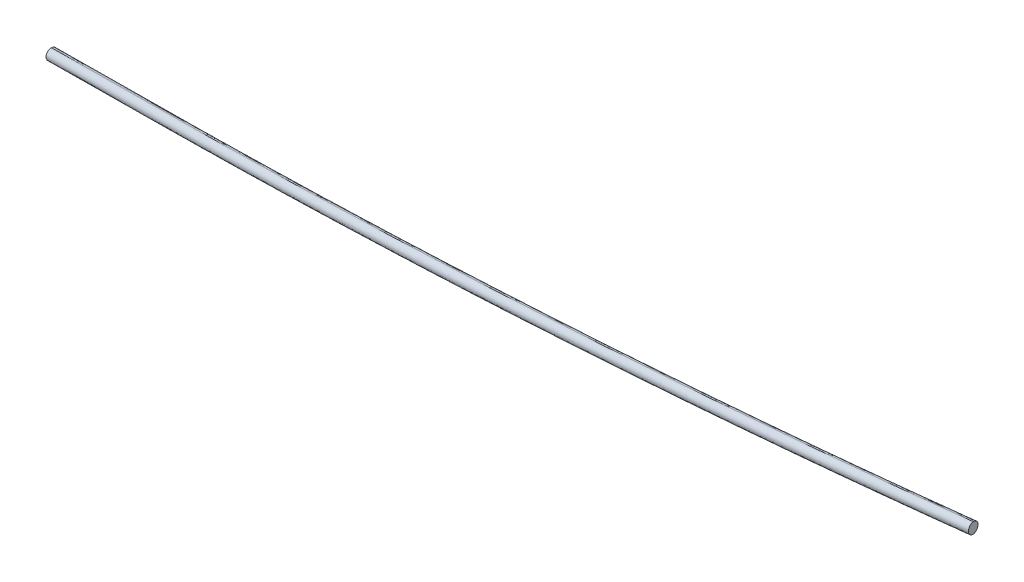
ISO-10303-21;
HEADER;
FILE_DESCRIPTION(('STEP AP214'),'2;1');
FILE_NAME('part.step','',(''),(''),'','','');
FILE_SCHEMA(('AUTOMOTIVE_DESIGN { 1 0 10303 214 1 1 1 1 }'));
ENDSEC;
DATA;
#1=APPLICATION_CONTEXT('core data for automotive mechanical design processes');
#2=APPLICATION_PROTOCOL_DEFINITION('international standard','automotive_design',2000,#1);
#3=PRODUCT_CONTEXT('',#1,'mechanical');
#4=PRODUCT('Part','Part','',(#3));
#5=PRODUCT_RELATED_PRODUCT_CATEGORY('part','',(#4));
#6=PRODUCT_DEFINITION_FORMATION('','',#4);
#7=PRODUCT_DEFINITION_CONTEXT('part definition',#1,'design');
#8=PRODUCT_DEFINITION('design','',#6,#7);
#9=PRODUCT_DEFINITION_SHAPE('','',#8);
#10=(LENGTH_UNIT() NAMED_UNIT(*) SI_UNIT(.MILLI.,.METRE.));
#11=(NAMED_UNIT(*) PLANE_ANGLE_UNIT() SI_UNIT($,.RADIAN.));
#12=(NAMED_UNIT(*) SI_UNIT($,.STERADIAN.) SOLID_ANGLE_UNIT());
#13=UNCERTAINTY_MEASURE_WITH_UNIT(LENGTH_MEASURE(1.E-05),#10,'distance_accuracy_value','');
#14=(GEOMETRIC_REPRESENTATION_CONTEXT(3) GLOBAL_UNCERTAINTY_ASSIGNED_CONTEXT((#13)) GLOBAL_UNIT_ASSIGNED_CONTEXT((#10,
#11,#12)) REPRESENTATION_CONTEXT('',''));
#15=CARTESIAN_POINT('',(0.,0.,0.));
#16=DIRECTION('',(0.,0.,1.));
#17=DIRECTION('',(1.,0.,0.));
#18=AXIS2_PLACEMENT_3D('',#15,#16,#17);
#19=CARTESIAN_POINT('',(47.8367929704556,0.820702680328424,-12.776442060778));
#20=DIRECTION('',(-0.993859021947617,-0.00906660618532011,0.110281644645005));
#21=DIRECTION('',(-0.00912224846437236,0.99995839142584,0.));
#22=AXIS2_PLACEMENT_3D('',#19,#20,#21);
#23=PLANE('',#22);
#24=CARTESIAN_POINT('',(47.8390735325717,0.570713082471964,-12.776442060778));
#25=CARTESIAN_POINT('',(47.835650118051,0.570681851934652,-12.807296466093));
#26=CARTESIAN_POINT('',(47.8287056984545,0.581317026962421,-12.869005276723));
#27=CARTESIAN_POINT('',(47.8183769649011,0.638470414265478,-12.957389139686));
#28=CARTESIAN_POINT('',(47.8112533891388,0.727334317022408,-13.014281073511));
#29=CARTESIAN_POINT('',(47.8086324819121,0.820445782665907,-13.030245718498));
#30=CARTESIAN_POINT('',(47.8095589219592,0.913589609439128,-13.014238982254));
#31=CARTESIAN_POINT('',(47.8150367514686,1.00256847012918,-12.957557504717));
#32=CARTESIAN_POINT('',(47.8244098081276,1.05990158953615,-12.868373907854));
#33=CARTESIAN_POINT('',(47.8311123447472,1.07066126066941,-12.807086009803));
#34=CARTESIAN_POINT('',(47.8345124083395,1.07069227818488,-12.776442060778));
#35=B_SPLINE_CURVE_WITH_KNOTS('',3,(#24,#25,#26,#27,#28,#29,#30,#31,#32,#33,#34),.UNSPECIFIED.,
.F.,.F.,(4,1,1,1,1,1,1,1,4),(0.,0.125,0.25,0.375,0.5,0.625,0.75,0.875,1.),.UNSPECIFIED.);
#36=CARTESIAN_POINT('',(47.8390735325717,0.570713082471964,-12.776442060778));
#37=VERTEX_POINT('',#36);
#38=CARTESIAN_POINT('',(47.8345124083395,1.07069227818488,-12.776442060778));
#39=VERTEX_POINT('',#38);
#40=EDGE_CURVE('E11',#37,#39,#35,.T.);
#41=ORIENTED_EDGE('',*,*,#40,.T.);
#42=CARTESIAN_POINT('',(47.8345124083395,1.07069227818488,-12.776442060778));
#43=CARTESIAN_POINT('',(47.8379124719318,1.07072329570036,-12.745798111752));
#44=CARTESIAN_POINT('',(47.8448101896615,1.06008769462883,-12.684510213701));
#45=CARTESIAN_POINT('',(47.8552276567527,1.00293511680884,-12.595326616839));
#46=CARTESIAN_POINT('',(47.8623278815767,0.914071001029983,-12.538645139302));
#47=CARTESIAN_POINT('',(47.864953458999,0.820959577990941,-12.522638403058));
#48=CARTESIAN_POINT('',(47.8640316891276,0.727815793821996,-12.538603048044));
#49=CARTESIAN_POINT('',(47.8585305086899,0.638836720110108,-12.59549498187));
#50=CARTESIAN_POINT('',(47.8492461855786,0.581504410186295,-12.683878844833));
#51=CARTESIAN_POINT('',(47.8424969470923,0.570744313009276,-12.745587655463));
#52=CARTESIAN_POINT('',(47.8390735325717,0.570713082471964,-12.776442060778));
#53=B_SPLINE_CURVE_WITH_KNOTS('',3,(#42,#43,#44,#45,#46,#47,#48,#49,#50,#51,#52),.UNSPECIFIED.,
.F.,.F.,(4,1,1,1,1,1,1,1,4),(0.,0.125,0.25,0.375,0.5,0.625,0.75,0.875,1.),.UNSPECIFIED.);
#54=EDGE_CURVE('E72',#39,#37,#53,.T.);
#55=ORIENTED_EDGE('',*,*,#54,.T.);
#56=EDGE_LOOP('',(#41,#55));
#57=FACE_BOUND('',#56,.T.);
#58=ADVANCED_FACE('F17',(#57),#23,.F.);
#59=CARTESIAN_POINT('',(6.49585297667772,0.309157456370087,-10.5891469422591));
#60=CARTESIAN_POINT('',(7.09129993623582,0.314589497502017,-10.589392958671));
#61=CARTESIAN_POINT('',(8.42600871502778,0.326765549237888,-10.588987452871));
#62=CARTESIAN_POINT('',(10.499330979002,0.345679697067298,-10.5899390919028));
#63=CARTESIAN_POINT('',(13.7338468100071,0.375186981895722,-10.5859629169388));
#64=CARTESIAN_POINT('',(26.3486769569708,0.490267385163673,-10.7117000519929));
#65=CARTESIAN_POINT('',(38.2118509161581,0.598490708613632,-11.4837330270633));
#66=CARTESIAN_POINT('',(48.2690194370734,0.690238516204942,-12.612487255157));
#67=CARTESIAN_POINT('',(6.49598846455756,0.294008844717859,-10.5988382920499));
#68=CARTESIAN_POINT('',(7.09144137670697,0.299440940153066,-10.5990846143667));
#69=CARTESIAN_POINT('',(8.42614154023141,0.311616913295056,-10.5986786706191));
#70=CARTESIAN_POINT('',(10.4994759933554,0.330531172321546,-10.5996309702892));
#71=CARTESIAN_POINT('',(13.7339328218126,0.360037918891672,-10.5956537595946));
#72=CARTESIAN_POINT('',(26.3484130663359,0.475115130129807,-10.7213902459349));
#73=CARTESIAN_POINT('',(38.2111858391367,0.583334793705585,-11.4933944191897));
#74=CARTESIAN_POINT('',(48.2680776286069,0.675080076778853,-12.622118407163));
#75=CARTESIAN_POINT('',(6.49635785259717,0.252507848513258,-10.631808189512));
#76=CARTESIAN_POINT('',(7.09183101541794,0.257940128687807,-10.6320555525151));
#77=CARTESIAN_POINT('',(8.42650186986894,0.270115834454022,-10.6316481188736));
#78=CARTESIAN_POINT('',(10.4998777903845,0.289030471772101,-10.6326026660299));
#79=CARTESIAN_POINT('',(13.734133892645,0.318535387191795,-10.6286219317877));
#80=CARTESIAN_POINT('',(26.3474237717597,0.433601739169072,-10.7543562112083));
#81=CARTESIAN_POINT('',(38.2088317115316,0.541808951880785,-11.5262624009081));
#82=CARTESIAN_POINT('',(48.2647820627853,0.633545646563378,-12.654883512225));
#83=CARTESIAN_POINT('',(6.49677705164663,0.204261215579839,-10.7067575492373));
#84=CARTESIAN_POINT('',(7.09229624963687,0.209693915716116,-10.7070072779977));
#85=CARTESIAN_POINT('',(8.42690047675625,0.221869013665967,-10.7065964574302));
#86=CARTESIAN_POINT('',(10.5003706636983,0.240784510941592,-10.7075561137215));
#87=CARTESIAN_POINT('',(13.7341704618318,0.27028526366846,-10.703567369517));
#88=CARTESIAN_POINT('',(26.3447543232747,0.385326929653038,-10.8292966320212));
#89=CARTESIAN_POINT('',(38.203059634008,0.493505838234073,-11.600980078999));
#90=CARTESIAN_POINT('',(48.2568698454036,0.585223009216778,-12.729367324269));
#91=CARTESIAN_POINT('',(6.49689742387773,0.188214524113787,-10.7998874906785));
#92=CARTESIAN_POINT('',(7.09247382385978,0.193647746082559,-10.8001401590615));
#93=CARTESIAN_POINT('',(8.42699526175304,0.205822088777094,-10.7997251299962));
#94=CARTESIAN_POINT('',(10.5005825814752,0.224738654611504,-10.8006911347533));
#95=CARTESIAN_POINT('',(13.7338153890903,0.254234234894768,-10.7966924375975));
#96=CARTESIAN_POINT('',(26.3410368299746,0.369245226767262,-10.9224154662242));
#97=CARTESIAN_POINT('',(38.1954869021655,0.477388965441055,-11.6938221394345));
#98=CARTESIAN_POINT('',(48.2466378366644,0.569081876829766,-12.821918789411));
#99=CARTESIAN_POINT('',(6.4967250244435,0.204260740955017,-10.8930174321198));
#100=CARTESIAN_POINT('',(7.09235862641735,0.209694484756283,-10.8932730401253));
#101=CARTESIAN_POINT('',(8.4267972750845,0.221868072195502,-10.8928538025623));
#102=CARTESIAN_POINT('',(10.5005017275857,0.240785706588687,-10.8938261557851));
#103=CARTESIAN_POINT('',(13.7331675446835,0.270276114428358,-10.889817505678));
#104=CARTESIAN_POINT('',(26.3370265650091,0.385256432188767,-11.0155343004272));
#105=CARTESIAN_POINT('',(38.1876213986576,0.493365000955318,-11.7866641998701));
#106=CARTESIAN_POINT('',(48.2361130562699,0.585033652750126,-12.914470254553));
#107=CARTESIAN_POINT('',(6.49617798017498,0.261503362971062,-10.9819424321647));
#108=CARTESIAN_POINT('',(7.09186620139411,0.266937605043387,-10.9822008470649));
#109=CARTESIAN_POINT('',(8.42622579887861,0.27911047132807,-10.9817775910234));
#110=CARTESIAN_POINT('',(10.5000420954579,0.298029126033178,-10.9827560060702));
#111=CARTESIAN_POINT('',(13.7321665224111,0.327514594971933,-10.9787378524009));
#112=CARTESIAN_POINT('',(26.3328149399709,0.442465623597513,-11.1044486947406));
#113=CARTESIAN_POINT('',(38.179728604254,0.550540610425176,-11.875314317122));
#114=CARTESIAN_POINT('',(48.2256810548835,0.642186097979154,-13.002842897277));
#115=CARTESIAN_POINT('',(6.495350793828,0.350424705346647,-11.0391826912847));
#116=CARTESIAN_POINT('',(7.0910741729852,0.355859268151764,-11.0394429129591));
#117=CARTESIAN_POINT('',(8.42538288590402,0.368031670235481,-11.0390170702574));
#118=CARTESIAN_POINT('',(10.4992711755557,0.38695098170661,-11.0399993872483));
#119=CARTESIAN_POINT('',(13.7310471143236,0.416433271517273,-11.0359751162176));
#120=CARTESIAN_POINT('',(26.3296288944468,0.531365446978217,-11.1616821270423));
#121=CARTESIAN_POINT('',(38.1741730216071,0.639418817400073,-11.932377636548));
#122=CARTESIAN_POINT('',(48.2184910064971,0.731049394331059,-13.059727608732));
#123=CARTESIAN_POINT('',(6.49449673850406,0.443552289322863,-11.0552450810527));
#124=CARTESIAN_POINT('',(7.09022998345474,0.448986942129945,-11.0555058097322));
#125=CARTESIAN_POINT('',(8.42452441747571,0.461159213952588,-11.0550792411788));
#126=CARTESIAN_POINT('',(10.4984329093568,0.480078709721141,-11.0560626531079));
#127=CARTESIAN_POINT('',(13.7301110576397,0.509560107425584,-11.052036665463));
#128=CARTESIAN_POINT('',(26.3281129113838,0.62448699243388,-11.1777426011129));
#129=CARTESIAN_POINT('',(38.1719921144218,0.732534297000289,-11.948390374648));
#130=CARTESIAN_POINT('',(48.2158514461566,0.824160689809139,-13.075690227023));
#131=CARTESIAN_POINT('',(6.49365166829125,0.536679955266907,-11.0391403423198));
#132=CARTESIAN_POINT('',(7.08937502143853,0.542114517834745,-11.0394005626574));
#133=CARTESIAN_POINT('',(8.42368377200278,0.554286920261888,-11.0389747218695));
#134=CARTESIAN_POINT('',(10.4975720083917,0.573206231247121,-11.0399570359736));
#135=CARTESIAN_POINT('',(13.7293482049888,0.602688523409864,-11.0359327694688));
#136=CARTESIAN_POINT('',(26.3279315140984,0.717620712819182,-11.1616397831282));
#137=CARTESIAN_POINT('',(38.1724773943558,0.82567409923389,-11.932335418491));
#138=CARTESIAN_POINT('',(48.2167965884955,0.917304687196412,-13.059685522817));
#139=CARTESIAN_POINT('',(6.49285640016814,0.625601588820576,-10.9821118280243));
#140=CARTESIAN_POINT('',(7.08854472543294,0.631035831842072,-10.9823702482715));
#141=CARTESIAN_POINT('',(8.4229041723317,0.643208696753017,-10.981946984575));
#142=CARTESIAN_POINT('',(10.4967206819662,0.662127353401748,-10.9829254111692));
#143=CARTESIAN_POINT('',(13.7288440776093,0.691612812932245,-10.9789072393963));
#144=CARTESIAN_POINT('',(26.3294863792035,0.806563785764147,-11.104618070397));
#145=CARTESIAN_POINT('',(38.1763930311085,0.914638708620491,-11.875483189349));
#146=CARTESIAN_POINT('',(48.2223406447292,1.00628415204824,-13.003011240935));
#147=CARTESIAN_POINT('',(6.49235925875915,0.682844666081847,-10.8923821976463));
#148=CARTESIAN_POINT('',(7.08799247056124,0.688278406323722,-10.8926377856008));
#149=CARTESIAN_POINT('',(8.42243168392889,0.700451998914493,-10.8922185767437));
#150=CARTESIAN_POINT('',(10.4961353374743,0.719369626019102,-10.893190886664));
#151=CARTESIAN_POINT('',(13.7288050219792,0.748860069139689,-10.8891823044454));
#152=CARTESIAN_POINT('',(26.3326869772105,0.863840596126712,-11.0148991417156));
#153=CARTESIAN_POINT('',(38.1833081072348,0.971949404785318,-11.7860309290179));
#154=CARTESIAN_POINT('',(48.2318179036323,1.06361822205352,-12.913838965836));
#155=CARTESIAN_POINT('',(6.49223870909043,0.698891355929201,-10.7998874906785));
#156=CARTESIAN_POINT('',(7.08781510907248,0.704324577897973,-10.8001401590615));
#157=CARTESIAN_POINT('',(8.42233654696575,0.716498920592508,-10.7997251299962));
#158=CARTESIAN_POINT('',(10.4959238666879,0.735415486426917,-10.8006911347533));
#159=CARTESIAN_POINT('',(13.729156674303,0.764911066710182,-10.7966924375975));
#160=CARTESIAN_POINT('',(26.3363781151873,0.879922058582676,-10.9224154662242));
#161=CARTESIAN_POINT('',(38.1908281873782,0.988065797256469,-11.6938221394345));
#162=CARTESIAN_POINT('',(48.2419791218771,1.07975870864518,-12.821918789411));
#163=CARTESIAN_POINT('',(6.49241093108805,0.682845137469284,-10.7073927837108));
#164=CARTESIAN_POINT('',(7.08793051924905,0.688277841164944,-10.7076425325222));
#165=CARTESIAN_POINT('',(8.42253418166793,0.700452933963242,-10.7072316832488));
#166=CARTESIAN_POINT('',(10.4960051675668,0.719368438527452,-10.7081913828426));
#167=CARTESIAN_POINT('',(13.7298010982921,0.748869155973395,-10.7042025707495));
#168=CARTESIAN_POINT('',(26.3403620248294,0.863910612731359,-10.8299317907328));
#169=CARTESIAN_POINT('',(38.1986410391868,0.972089281420339,-11.6016133498511));
#170=CARTESIAN_POINT('',(48.2524331117872,1.06380628692956,-12.729998612986));
#171=CARTESIAN_POINT('',(6.49287219015838,0.634598888233791,-10.6317652510504));
#172=CARTESIAN_POINT('',(7.08834532660426,0.640031168167731,-10.6320126126982));
#173=CARTESIAN_POINT('',(8.42301621922666,0.65220687428217,-10.631605180997));
#174=CARTESIAN_POINT('',(10.4963920857364,0.671121511107574,-10.6325597252264));
#175=CARTESIAN_POINT('',(13.7306484494121,0.700626428912061,-10.6285789955731));
#176=CARTESIAN_POINT('',(26.3439398788023,0.815692795031925,-10.7543132778678));
#177=CARTESIAN_POINT('',(38.2053495960702,0.923900023959073,-11.5262195951769));
#178=CARTESIAN_POINT('',(48.2613011734129,1.01563672982682,-12.654840840475));
#179=CARTESIAN_POINT('',(6.49326000085342,0.593098060092222,-10.5987811594707));
#180=CARTESIAN_POINT('',(7.08871287791129,0.598530155207302,-10.5990274799841));
#181=CARTESIAN_POINT('',(8.42341309222461,0.61070612881262,-10.5986215388184));
#182=CARTESIAN_POINT('',(10.4967474734906,0.629620387183576,-10.5995738345938));
#183=CARTESIAN_POINT('',(13.7312046497773,0.659127136926821,-10.5955966300051));
#184=CARTESIAN_POINT('',(26.3456869570548,0.774204366982696,-10.7213331201696));
#185=CARTESIAN_POINT('',(38.2084620949271,0.882424052134142,-11.4933374632173));
#186=CARTESIAN_POINT('',(48.2653555157995,0.974169350090085,-12.622061629463));
#187=CARTESIAN_POINT('',(6.4934008997081,0.577949497802306,-10.5891009591103));
#188=CARTESIAN_POINT('',(7.08884783102238,0.583381538676578,-10.5893469740708));
#189=CARTESIAN_POINT('',(8.42355665069163,0.595557590785358,-10.5889414703487));
#190=CARTESIAN_POINT('',(10.4968788568312,0.614471738087164,-10.5898931062459));
#191=CARTESIAN_POINT('',(13.7313949677827,0.643979025469434,-10.5859169361962));
#192=CARTESIAN_POINT('',(26.3462267749573,0.759059443882872,-10.7116540743284));
#193=CARTESIAN_POINT('',(38.2094026376754,0.867282784698034,-11.4836871860565));
#194=CARTESIAN_POINT('',(48.2665724716161,0.959030604267586,-12.612441557633));
#195=B_SPLINE_SURFACE_WITH_KNOTS('',3,3,((#59,#60,#61,#62,#63,#64,#65,#66),(#67,#68,#69,#70,#71,
#72,#73,#74),(#75,#76,#77,#78,#79,#80,#81,#82),(#83,#84,#85,#86,#87,#88,#89,#90),(#91,#92,#93,
#94,#95,#96,#97,#98),(#99,#100,#101,#102,#103,#104,#105,#106),(#107,#108,#109,#110,#111,#112,
#113,#114),(#115,#116,#117,#118,#119,#120,#121,#122),(#123,#124,#125,#126,#127,#128,#129,#130),
(#131,#132,#133,#134,#135,#136,#137,#138),(#139,#140,#141,#142,#143,#144,#145,#146),(#147,#148,
#149,#150,#151,#152,#153,#154),(#155,#156,#157,#158,#159,#160,#161,#162),(#163,#164,#165,#166,
#167,#168,#169,#170),(#171,#172,#173,#174,#175,#176,#177,#178),(#179,#180,#181,#182,#183,#184,
#185,#186),(#187,#188,#189,#190,#191,#192,#193,#194)),.UNSPECIFIED.,.F.,.F.,.F.,(4,1,1,1,1,1,1,
1,1,1,1,1,1,1,4),(4,1,1,1,1,4),(0.,0.0404773357775488,0.117064446481301,0.193651557185053,
0.270238667888805,0.346825778592557,0.423412889296309,0.500000000000061,0.576587110703813,
0.653174221407565,0.729761332111317,0.80634844281507,0.882935553518822,0.959522664222574,1.),
(0.,0.0427231708491105,0.0957280892241252,0.148730618500451,0.274614629049837,1.),.UNSPECIFIED.);
#196=CARTESIAN_POINT('',(6.90199546095475,0.697280151172529,-10.8));
#197=CARTESIAN_POINT('',(7.36100954674141,0.70146756594408,-10.8000660708699));
#198=CARTESIAN_POINT('',(8.55896883985224,0.712396102986885,-10.7997887590063));
#199=CARTESIAN_POINT('',(10.4959726619654,0.730066668375671,-10.8006911347533));
#200=CARTESIAN_POINT('',(13.7292054695805,0.759562248658936,-10.7966924375975));
#201=CARTESIAN_POINT('',(26.1997588695338,0.873326468828524,-10.9210525711483));
#202=CARTESIAN_POINT('',(37.9178573123176,0.980226322304054,-11.6761426005174));
#203=CARTESIAN_POINT('',(47.8345124083395,1.07069227818488,-12.776442060778));
#204=B_SPLINE_CURVE_WITH_KNOTS('',3,(#196,#197,#198,#199,#200,#201,#202,#203),.UNSPECIFIED.,.F.,
.F.,(4,1,1,1,1,4),(0.,0.03358479009447,0.08764933799105,0.1417114490281,0.270112026303,1.),.UNSPECIFIED.);
#205=CARTESIAN_POINT('',(6.90199546095475,0.697280151172529,-10.8));
#206=VERTEX_POINT('',#205);
#207=EDGE_CURVE('E67',#206,#39,#204,.T.);
#208=CARTESIAN_POINT('',(6.90655658518693,0.197300955459609,-10.8));
#209=CARTESIAN_POINT('',(7.36557067097359,0.20148837023116,-10.8000660708699));
#210=CARTESIAN_POINT('',(8.56352996408443,0.212416907273965,-10.7997887590063));
#211=CARTESIAN_POINT('',(10.5005337861976,0.23008747266275,-10.8006911347533));
#212=CARTESIAN_POINT('',(13.7337665938127,0.259583052946015,-10.7966924375975));
#213=CARTESIAN_POINT('',(26.2043199937659,0.373347273115604,-10.9210525711483));
#214=CARTESIAN_POINT('',(37.9224184365498,0.480247126591134,-11.6761426005174));
#215=CARTESIAN_POINT('',(47.8390735325717,0.570713082471964,-12.776442060778));
#216=B_SPLINE_CURVE_WITH_KNOTS('',3,(#208,#209,#210,#211,#212,#213,#214,#215),.UNSPECIFIED.,.F.,
.F.,(4,1,1,1,1,4),(0.,0.03358479009447,0.08764933799105,0.1417114490281,0.270112026303,1.),.UNSPECIFIED.);
#217=CARTESIAN_POINT('',(6.90655658518693,0.197300955459609,-10.8));
#218=VERTEX_POINT('',#217);
#219=EDGE_CURVE('E23',#218,#37,#216,.T.);
#220=CARTESIAN_POINT('',(6.90199546095475,0.697280151172529,-10.8));
#221=CARTESIAN_POINT('',(6.90199546095475,0.697280151172529,-10.8308320126877));
#222=CARTESIAN_POINT('',(6.90209305150986,0.686582515070136,-10.8924960380632));
#223=CARTESIAN_POINT('',(6.90261525672593,0.629339666456654,-10.9822269597442));
#224=CARTESIAN_POINT('',(6.90342645438821,0.540418178222246,-11.0392562947397));
#225=CARTESIAN_POINT('',(6.90427602307084,0.447290553316069,-11.0553612652366));
#226=CARTESIAN_POINT('',(6.90512559175347,0.354162928409892,-11.039298644314));
#227=CARTESIAN_POINT('',(6.90593678941575,0.265241440175484,-10.9820575614469));
#228=CARTESIAN_POINT('',(6.90645899463182,0.207998591562003,-10.8931312816783));
#229=CARTESIAN_POINT('',(6.90655658518693,0.197300955459609,-10.8310437605594));
#230=CARTESIAN_POINT('',(6.90655658518693,0.197300955459609,-10.8));
#231=B_SPLINE_CURVE_WITH_KNOTS('',3,(#220,#221,#222,#223,#224,#225,#226,#227,#228,#229,#230),
.UNSPECIFIED.,.F.,.F.,(4,1,1,1,1,1,1,1,4),(0.,0.125,0.25,0.375,0.5,0.625,0.75,0.875,1.),.UNSPECIFIED.);
#232=EDGE_CURVE('E31',#206,#218,#231,.T.);
#233=ORIENTED_EDGE('',*,*,#207,.T.);
#234=ORIENTED_EDGE('',*,*,#40,.F.);
#235=ORIENTED_EDGE('',*,*,#219,.F.);
#236=ORIENTED_EDGE('',*,*,#232,.F.);
#237=EDGE_LOOP('',(#233,#234,#235,#236));
#238=FACE_BOUND('',#237,.T.);
#239=ADVANCED_FACE('F70',(#238),#195,.T.);
#240=CARTESIAN_POINT('',(6.90427602307084,0.447290553316069,-10.8));
#241=DIRECTION('',(-0.99995839142584,-0.00912224846437237,0.));
#242=DIRECTION('',(-0.00912224846437237,0.99995839142584,0.));
#243=AXIS2_PLACEMENT_3D('',#240,#241,#242);
#244=PLANE('',#243);
#245=CARTESIAN_POINT('',(6.90655658518693,0.197300955459609,-10.8));
#246=CARTESIAN_POINT('',(6.90655658518693,0.197300955459609,-10.7689562394405));
#247=CARTESIAN_POINT('',(6.90645899463182,0.207998591562003,-10.7068687183216));
#248=CARTESIAN_POINT('',(6.90593678941575,0.265241440175484,-10.6179424385531));
#249=CARTESIAN_POINT('',(6.90512559175347,0.354162928409892,-10.560701355686));
#250=CARTESIAN_POINT('',(6.90427602307084,0.447290553316069,-10.5446387347634));
#251=CARTESIAN_POINT('',(6.90342645438821,0.540418178222246,-10.5607437052603));
#252=CARTESIAN_POINT('',(6.90261525672593,0.629339666456654,-10.6177730402558));
#253=CARTESIAN_POINT('',(6.90209305150986,0.686582515070136,-10.7075039619368));
#254=CARTESIAN_POINT('',(6.90199546095475,0.697280151172529,-10.7691679873123));
#255=CARTESIAN_POINT('',(6.90199546095475,0.697280151172529,-10.8));
#256=B_SPLINE_CURVE_WITH_KNOTS('',3,(#245,#246,#247,#248,#249,#250,#251,#252,#253,#254,#255),
.UNSPECIFIED.,.F.,.F.,(4,1,1,1,1,1,1,1,4),(0.,0.125,0.25,0.375,0.5,0.625,0.75,0.875,1.),.UNSPECIFIED.);
#257=EDGE_CURVE('E60',#218,#206,#256,.T.);
#258=ORIENTED_EDGE('',*,*,#257,.T.);
#259=ORIENTED_EDGE('',*,*,#232,.T.);
#260=EDGE_LOOP('',(#258,#259));
#261=FACE_BOUND('',#260,.T.);
#262=ADVANCED_FACE('F59',(#261),#244,.T.);
#263=CARTESIAN_POINT('',(6.49328314344698,0.577948423555736,-11.0106740222467));
#264=CARTESIAN_POINT('',(7.08898901209579,0.583382826618998,-11.0109333440522));
#265=CARTESIAN_POINT('',(8.42332306821307,0.595555459899288,-11.0105087896438));
#266=CARTESIAN_POINT('',(10.4971755015167,0.614474444266292,-11.0114891632607));
#267=CARTESIAN_POINT('',(13.7291250057865,0.643958317450469,-11.0074679389987));
#268=CARTESIAN_POINT('',(26.3287360803904,0.758899882782109,-11.13317685812));
#269=CARTESIAN_POINT('',(38.1744603620542,0.866964019314533,-11.903957092813));
#270=CARTESIAN_POINT('',(48.2195923971213,0.958602022522495,-13.03139602119));
#271=CARTESIAN_POINT('',(6.49314765245327,0.593097035179557,-11.0009938218864));
#272=CARTESIAN_POINT('',(7.08884757535849,0.598531384002011,-11.0012528381389));
#273=CARTESIAN_POINT('',(8.4231902368317,0.610704095785763,-11.0008287211741));
#274=CARTESIAN_POINT('',(10.49703049501,0.629622969083626,-11.0018084349128));
#275=CARTESIAN_POINT('',(13.7290389339434,0.65910737990682,-10.9977882451899));
#276=CARTESIAN_POINT('',(26.3289995084446,0.774052133596023,-11.1234978122788));
#277=CARTESIAN_POINT('',(38.175124514954,0.882119925792163,-11.894306815652));
#278=CARTESIAN_POINT('',(48.2205329630896,0.973760450613734,-13.021775949359));
#279=CARTESIAN_POINT('',(6.4927782683775,0.634598031420318,-10.9680097303067));
#280=CARTESIAN_POINT('',(7.08845793189372,0.640032195423903,-10.9682677054248));
#281=CARTESIAN_POINT('',(8.42282991505884,0.652205174698543,-10.9678450789955));
#282=CARTESIAN_POINT('',(10.4966286879923,0.671123669541949,-10.9688225442802));
#283=CARTESIAN_POINT('',(13.7288379395479,0.700609912304001,-10.9648058796219));
#284=CARTESIAN_POINT('',(26.3299893919263,0.815565529929124,-11.0905176545806));
#285=CARTESIAN_POINT('',(38.1774798190401,0.923645778349561,-11.861424683692));
#286=CARTESIAN_POINT('',(48.2238301107053,1.01529489525933,-12.988996738347));
#287=CARTESIAN_POINT('',(6.49235925875915,0.682844666081847,-10.8923821976463));
#288=CARTESIAN_POINT('',(7.08799247056124,0.688278406323722,-10.8926377856008));
#289=CARTESIAN_POINT('',(8.42243168392889,0.700451998914493,-10.8922185767437));
#290=CARTESIAN_POINT('',(10.4961353374743,0.719369626019102,-10.893190886664));
#291=CARTESIAN_POINT('',(13.7288050219792,0.748860069139689,-10.8891823044454));
#292=CARTESIAN_POINT('',(26.3326869772105,0.863840596126712,-11.0148991417156));
#293=CARTESIAN_POINT('',(38.1833081072348,0.971949404785318,-11.7860309290179));
#294=CARTESIAN_POINT('',(48.2318179036323,1.06361822205352,-12.913838965836));
#295=CARTESIAN_POINT('',(6.49223870909043,0.698891355929201,-10.7998874906785));
#296=CARTESIAN_POINT('',(7.08781510907248,0.704324577897973,-10.8001401590615));
#297=CARTESIAN_POINT('',(8.42233654696575,0.716498920592508,-10.7997251299962));
#298=CARTESIAN_POINT('',(10.4959238666879,0.735415486426917,-10.8006911347533));
#299=CARTESIAN_POINT('',(13.729156674303,0.764911066710182,-10.7966924375975));
#300=CARTESIAN_POINT('',(26.3363781151873,0.879922058582676,-10.9224154662242));
#301=CARTESIAN_POINT('',(38.1908281873782,0.988065797256469,-11.6938221394345));
#302=CARTESIAN_POINT('',(48.2419791218771,1.07975870864518,-12.821918789411));
#303=CARTESIAN_POINT('',(6.49241093108805,0.682845137469284,-10.7073927837108));
#304=CARTESIAN_POINT('',(7.08793051924905,0.688277841164944,-10.7076425325222));
#305=CARTESIAN_POINT('',(8.42253418166793,0.700452933963242,-10.7072316832488));
#306=CARTESIAN_POINT('',(10.4960051675668,0.719368438527452,-10.7081913828426));
#307=CARTESIAN_POINT('',(13.7298010982921,0.748869155973395,-10.7042025707495));
#308=CARTESIAN_POINT('',(26.3403620248294,0.863910612731359,-10.8299317907328));
#309=CARTESIAN_POINT('',(38.1986410391868,0.972089281420339,-11.6016133498511));
#310=CARTESIAN_POINT('',(48.2524331117872,1.06380628692956,-12.729998612986));
#311=CARTESIAN_POINT('',(6.49295820011021,0.625602517503583,-10.6176631533328));
#312=CARTESIAN_POINT('',(7.0884226748095,0.631034718419631,-10.6179100698515));
#313=CARTESIAN_POINT('',(8.42310610369727,0.643210538897755,-10.6175032754174));
#314=CARTESIAN_POINT('',(10.4964642335071,0.662125013917843,-10.6184568583374));
#315=CARTESIAN_POINT('',(13.7308064530942,0.691630714953877,-10.6144776357987));
#316=CARTESIAN_POINT('',(26.3446070332685,0.806701725866962,-10.7402128620514));
#317=CARTESIAN_POINT('',(38.2066005257454,0.914914280358203,-11.5121610895201));
#318=CARTESIAN_POINT('',(48.2629547811325,1.00665465970797,-12.640826337888));
#319=CARTESIAN_POINT('',(6.49378532731166,0.536681174588435,-10.5606346390372));
#320=CARTESIAN_POINT('',(7.08921477412847,0.542113055958141,-10.5608797554656));
#321=CARTESIAN_POINT('',(8.42394889935075,0.554289338920068,-10.560475538123));
#322=CARTESIAN_POINT('',(10.4972353024061,0.573203159603654,-10.561425233533));
#323=CARTESIAN_POINT('',(13.7319247210392,0.602712028007441,-10.5574521057262));
#324=CARTESIAN_POINT('',(26.3477842936982,0.717801822343109,-10.6831911493202));
#325=CARTESIAN_POINT('',(38.2121385578226,0.826035913275987,-11.4553088603783));
#326=CARTESIAN_POINT('',(48.2701212326808,0.917791148090888,-12.584152056005));
#327=CARTESIAN_POINT('',(6.4946393944651,0.443553590720134,-10.5445299003044));
#328=CARTESIAN_POINT('',(7.09005894947752,0.448985381850588,-10.5447745083908));
#329=CARTESIAN_POINT('',(8.42480739124308,0.461161795417014,-10.5443710188137));
#330=CARTESIAN_POINT('',(10.4980735388053,0.48007543131727,-10.5453196163987));
#331=CARTESIAN_POINT('',(13.7328610057535,0.509585194179367,-10.541348209732));
#332=CARTESIAN_POINT('',(26.349302033788,0.62468029291615,-10.6670883313355));
#333=CARTESIAN_POINT('',(38.2143229751218,0.732920465697234,-11.4392539042214));
#334=CARTESIAN_POINT('',(48.2727655123949,0.824679895665898,-12.5681473518));
#335=CARTESIAN_POINT('',(6.49548447650643,0.350425924883998,-10.5605922900723));
#336=CARTESIAN_POINT('',(7.09091389731132,0.355857806016406,-10.5608374051639));
#337=CARTESIAN_POINT('',(8.42564806018004,0.368034089321768,-10.5604331897351));
#338=CARTESIAN_POINT('',(10.4989344099716,0.386947909519448,-10.5613828822583));
#339=CARTESIAN_POINT('',(13.733624086425,0.416456780275233,-10.5574097589773));
#340=CARTESIAN_POINT('',(26.3494851880803,0.531546588559367,-10.6831488054061));
#341=CARTESIAN_POINT('',(38.2138412053018,0.639780695485098,-11.4552666423215));
#342=CARTESIAN_POINT('',(48.2718250894096,0.731535941331534,-12.584109970091));
#343=CARTESIAN_POINT('',(6.496279685484,0.261504290790766,-10.6178325491924));
#344=CARTESIAN_POINT('',(7.09174426422796,0.266936492655975,-10.6180794710581));
#345=CARTESIAN_POINT('',(8.42642754252999,0.279112311760362,-10.6176726689691));
#346=CARTESIAN_POINT('',(10.4997858853939,0.298026788724063,-10.6186262634364));
#347=CARTESIAN_POINT('',(13.734127073662,0.327532480351756,-10.614647022794));
#348=CARTESIAN_POINT('',(26.3479215378807,0.442603435471254,-10.7403822377078));
#349=CARTESIAN_POINT('',(38.2099080179794,0.550815925991176,-11.5123299617474));
#350=CARTESIAN_POINT('',(48.2662574363578,0.642556261214713,-12.640994681545));
#351=CARTESIAN_POINT('',(6.49677705164663,0.204261215579839,-10.7067575492373));
#352=CARTESIAN_POINT('',(7.09229624963687,0.209693915716116,-10.7070072779977));
#353=CARTESIAN_POINT('',(8.42690047675625,0.221869013665967,-10.7065964574302));
#354=CARTESIAN_POINT('',(10.5003706636983,0.240784510941592,-10.7075561137215));
#355=CARTESIAN_POINT('',(13.7341704618318,0.27028526366846,-10.703567369517));
#356=CARTESIAN_POINT('',(26.3447543232747,0.385326929653038,-10.8292966320212));
#357=CARTESIAN_POINT('',(38.203059634008,0.493505838234073,-11.600980078999));
#358=CARTESIAN_POINT('',(48.2568698454036,0.585223009216778,-12.729367324269));
#359=CARTESIAN_POINT('',(6.49689742387773,0.188214524113787,-10.7998874906785));
#360=CARTESIAN_POINT('',(7.09247382385978,0.193647746082559,-10.8001401590615));
#361=CARTESIAN_POINT('',(8.42699526175304,0.205822088777094,-10.7997251299962));
#362=CARTESIAN_POINT('',(10.5005825814752,0.224738654611504,-10.8006911347533));
#363=CARTESIAN_POINT('',(13.7338153890903,0.254234234894768,-10.7966924375975));
#364=CARTESIAN_POINT('',(26.3410368299746,0.369245226767262,-10.9224154662242));
#365=CARTESIAN_POINT('',(38.1954869021655,0.477388965441055,-11.6938221394345));
#366=CARTESIAN_POINT('',(48.2466378366644,0.569081876829766,-12.821918789411));
#367=CARTESIAN_POINT('',(6.4967250244435,0.204260740955017,-10.8930174321198));
#368=CARTESIAN_POINT('',(7.09235862641735,0.209694484756283,-10.8932730401253));
#369=CARTESIAN_POINT('',(8.4267972750845,0.221868072195502,-10.8928538025623));
#370=CARTESIAN_POINT('',(10.5005017275857,0.240785706588687,-10.8938261557851));
#371=CARTESIAN_POINT('',(13.7331675446835,0.270276114428358,-10.889817505678));
#372=CARTESIAN_POINT('',(26.3370265650091,0.385256432188767,-11.0155343004272));
#373=CARTESIAN_POINT('',(38.1876213986576,0.493365000955318,-11.7866641998701));
#374=CARTESIAN_POINT('',(48.2361130562699,0.585033652750126,-12.914470254553));
#375=CARTESIAN_POINT('',(6.49626395480428,0.25250699191862,-10.9679667918451));
#376=CARTESIAN_POINT('',(7.0919435919476,0.257941155681614,-10.9682247656079));
#377=CARTESIAN_POINT('',(8.42631561328314,0.270114135304469,-10.9678021411189));
#378=CARTESIAN_POINT('',(10.5001143322119,0.289032629655209,-10.9687796034767));
#379=CARTESIAN_POINT('',(13.7323238451816,0.318518874802045,-10.9647629434073));
#380=CARTESIAN_POINT('',(26.3334768478354,0.433474506569755,-11.0904747212401));
#381=CARTESIAN_POINT('',(38.1809690524453,0.541554771205627,-11.861381877961));
#382=CARTESIAN_POINT('',(48.2273205701995,0.633203899300548,-12.988954066597));
#383=CARTESIAN_POINT('',(6.49587614807409,0.294007820096357,-11.0009366893072));
#384=CARTESIAN_POINT('',(7.09157603588776,0.299442168598685,-11.0011957037563));
#385=CARTESIAN_POINT('',(8.42591874814986,0.311614880845765,-11.0007715893733));
#386=CARTESIAN_POINT('',(10.4997589344701,0.330533753488094,-11.0017512992174));
#387=CARTESIAN_POINT('',(13.7317677212431,0.360018167484498,-10.9977311156003));
#388=CARTESIAN_POINT('',(26.3317303584884,0.47496293999135,-11.1234406865135));
#389=CARTESIAN_POINT('',(38.1778577300695,0.583030753763158,-11.894249859679));
#390=CARTESIAN_POINT('',(48.2232678095971,0.674671293467312,-13.021719171659));
#391=CARTESIAN_POINT('',(6.49573524610553,0.309156382357867,-11.0106280390979));
#392=CARTESIAN_POINT('',(7.09144108651052,0.314590785163472,-11.010887359452));
#393=CARTESIAN_POINT('',(8.4257751835051,0.32676341881667,-11.0104628071215));
#394=CARTESIAN_POINT('',(10.4996275589742,0.34568240265607,-11.0114431776038));
#395=CARTESIAN_POINT('',(13.7315773432003,0.375166278394185,-11.0074219582562));
#396=CARTESIAN_POINT('',(26.3311900780051,0.490107858871221,-11.1331308804555));
#397=CARTESIAN_POINT('',(38.1769162631997,0.598172012768848,-11.903911251806));
#398=CARTESIAN_POINT('',(48.2220496112922,0.689810027955052,-13.031350323665));
#399=B_SPLINE_SURFACE_WITH_KNOTS('',3,3,((#263,#264,#265,#266,#267,#268,#269,#270),(#271,#272,
#273,#274,#275,#276,#277,#278),(#279,#280,#281,#282,#283,#284,#285,#286),(#287,#288,#289,#290,
#291,#292,#293,#294),(#295,#296,#297,#298,#299,#300,#301,#302),(#303,#304,#305,#306,#307,#308,
#309,#310),(#311,#312,#313,#314,#315,#316,#317,#318),(#319,#320,#321,#322,#323,#324,#325,#326),
(#327,#328,#329,#330,#331,#332,#333,#334),(#335,#336,#337,#338,#339,#340,#341,#342),(#343,#344,
#345,#346,#347,#348,#349,#350),(#351,#352,#353,#354,#355,#356,#357,#358),(#359,#360,#361,#362,
#363,#364,#365,#366),(#367,#368,#369,#370,#371,#372,#373,#374),(#375,#376,#377,#378,#379,#380,
#381,#382),(#383,#384,#385,#386,#387,#388,#389,#390),(#391,#392,#393,#394,#395,#396,#397,#398)),
.UNSPECIFIED.,.F.,.F.,.F.,(4,1,1,1,1,1,1,1,1,1,1,1,1,1,4),(4,1,1,1,1,4),(0.,0.0404773357775439,
0.117064446481287,0.193651557185029,0.270238667888772,0.346825778592515,0.423412889296257,0.5,
0.576587110703743,0.653174221407485,0.729761332111228,0.806348442814971,0.882935553518713,
0.959522664222456,1.),(0.,0.0427231708491105,0.0957280892241252,0.148730618500451,
0.274614629049837,1.),.UNSPECIFIED.);
#400=ORIENTED_EDGE('',*,*,#219,.T.);
#401=ORIENTED_EDGE('',*,*,#54,.F.);
#402=ORIENTED_EDGE('',*,*,#207,.F.);
#403=ORIENTED_EDGE('',*,*,#257,.F.);
#404=EDGE_LOOP('',(#400,#401,#402,#403));
#405=FACE_BOUND('',#404,.T.);
#406=ADVANCED_FACE('F19',(#405),#399,.T.);
#407=CLOSED_SHELL('',(#58,#239,#262,#406));
#408=MANIFOLD_SOLID_BREP('B1',#407);
#409=ADVANCED_BREP_SHAPE_REPRESENTATION('',(#18,#408),#14);
#410=SHAPE_DEFINITION_REPRESENTATION(#9,#409);
ENDSEC;
END-ISO-10303-21;
